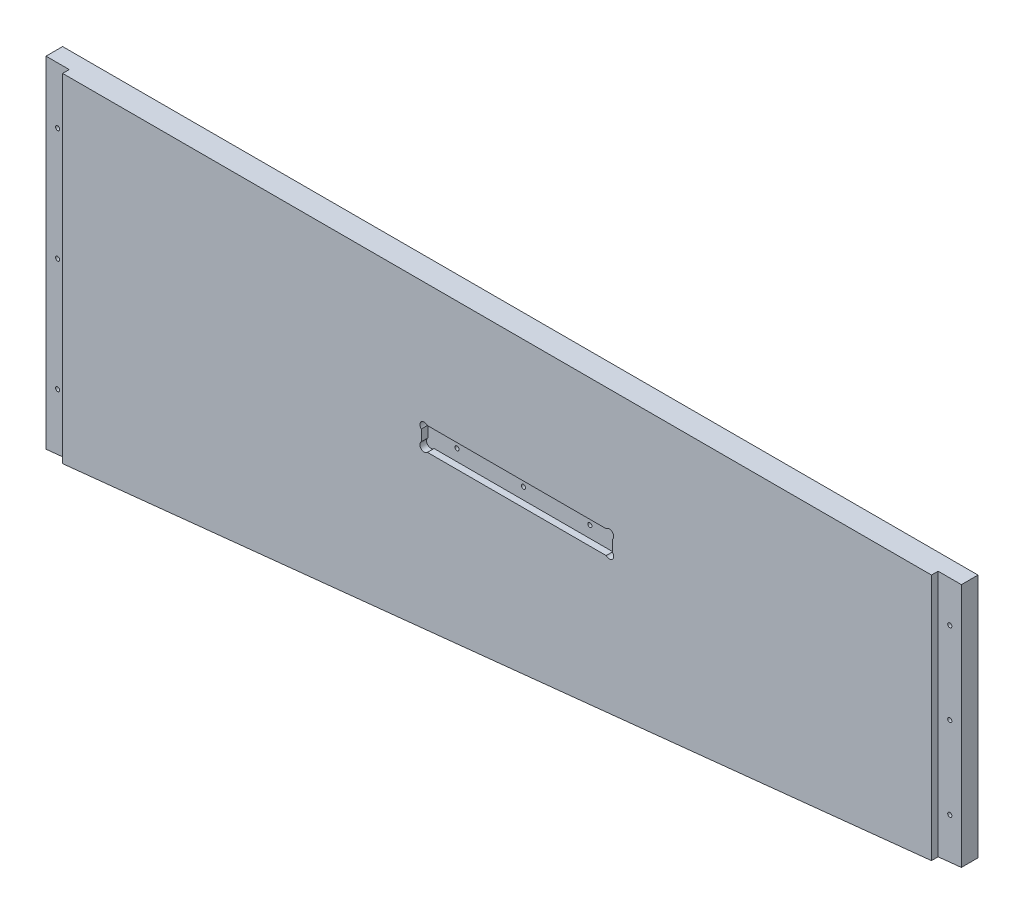
ISO-10303-21;
HEADER;
FILE_DESCRIPTION(('STEP AP214'),'2;1');
FILE_NAME('part.step','',(''),(''),'','','');
FILE_SCHEMA(('AUTOMOTIVE_DESIGN { 1 0 10303 214 1 1 1 1 }'));
ENDSEC;
DATA;
#1=APPLICATION_CONTEXT('core data for automotive mechanical design processes');
#2=APPLICATION_PROTOCOL_DEFINITION('international standard','automotive_design',2000,#1);
#3=PRODUCT_CONTEXT('',#1,'mechanical');
#4=PRODUCT('Part','Part','',(#3));
#5=PRODUCT_RELATED_PRODUCT_CATEGORY('part','',(#4));
#6=PRODUCT_DEFINITION_FORMATION('','',#4);
#7=PRODUCT_DEFINITION_CONTEXT('part definition',#1,'design');
#8=PRODUCT_DEFINITION('design','',#6,#7);
#9=PRODUCT_DEFINITION_SHAPE('','',#8);
#10=(LENGTH_UNIT() NAMED_UNIT(*) SI_UNIT(.MILLI.,.METRE.));
#11=(NAMED_UNIT(*) PLANE_ANGLE_UNIT() SI_UNIT($,.RADIAN.));
#12=(NAMED_UNIT(*) SI_UNIT($,.STERADIAN.) SOLID_ANGLE_UNIT());
#13=UNCERTAINTY_MEASURE_WITH_UNIT(LENGTH_MEASURE(1.E-05),#10,'distance_accuracy_value','');
#14=(GEOMETRIC_REPRESENTATION_CONTEXT(3) GLOBAL_UNCERTAINTY_ASSIGNED_CONTEXT((#13)) GLOBAL_UNIT_ASSIGNED_CONTEXT((#10,
#11,#12)) REPRESENTATION_CONTEXT('',''));
#15=CARTESIAN_POINT('',(0.,0.,0.));
#16=DIRECTION('',(0.,0.,1.));
#17=DIRECTION('',(1.,0.,0.));
#18=AXIS2_PLACEMENT_3D('',#15,#16,#17);
#19=CARTESIAN_POINT('',(573.0875,-5417.566,-22.2701280605353));
#20=DIRECTION('',(0.,0.,1.));
#21=DIRECTION('',(1.,0.,0.));
#22=AXIS2_PLACEMENT_3D('',#19,#20,#21);
#23=CYLINDRICAL_SURFACE('',#22,1.58749999999985);
#24=CARTESIAN_POINT('',(573.0875,-5417.566,-17.78));
#25=DIRECTION('',(0.,0.,1.));
#26=DIRECTION('',(1.,0.,0.));
#27=AXIS2_PLACEMENT_3D('',#24,#25,#26);
#28=CIRCLE('',#27,1.58749999999985);
#29=CARTESIAN_POINT('',(574.675,-5417.566,-17.78));
#30=VERTEX_POINT('',#29);
#31=EDGE_CURVE('E244',#30,#30,#28,.F.);
#32=ORIENTED_EDGE('',*,*,#31,.T.);
#33=EDGE_LOOP('',(#32));
#34=FACE_BOUND('',#33,.T.);
#35=CARTESIAN_POINT('',(573.0875,-5417.566,-5.08));
#36=DIRECTION('',(0.,0.,1.));
#37=DIRECTION('',(1.,0.,0.));
#38=AXIS2_PLACEMENT_3D('',#35,#36,#37);
#39=CIRCLE('',#38,1.58749999999985);
#40=CARTESIAN_POINT('',(574.675,-5417.566,-5.08));
#41=VERTEX_POINT('',#40);
#42=EDGE_CURVE('E187',#41,#41,#39,.F.);
#43=ORIENTED_EDGE('',*,*,#42,.F.);
#44=EDGE_LOOP('',(#43));
#45=FACE_BOUND('',#44,.T.);
#46=ADVANCED_FACE('F31',(#34,#45),#23,.F.);
#47=CARTESIAN_POINT('',(522.2875,-5417.566,-22.2701280605353));
#48=DIRECTION('',(0.,0.,1.));
#49=DIRECTION('',(1.,0.,0.));
#50=AXIS2_PLACEMENT_3D('',#47,#48,#49);
#51=CYLINDRICAL_SURFACE('',#50,1.58749999999964);
#52=CARTESIAN_POINT('',(522.2875,-5417.566,-17.78));
#53=DIRECTION('',(0.,0.,1.));
#54=DIRECTION('',(1.,0.,0.));
#55=AXIS2_PLACEMENT_3D('',#52,#53,#54);
#56=CIRCLE('',#55,1.58749999999964);
#57=CARTESIAN_POINT('',(523.875,-5417.566,-17.78));
#58=VERTEX_POINT('',#57);
#59=EDGE_CURVE('E241',#58,#58,#56,.F.);
#60=ORIENTED_EDGE('',*,*,#59,.T.);
#61=EDGE_LOOP('',(#60));
#62=FACE_BOUND('',#61,.T.);
#63=CARTESIAN_POINT('',(522.2875,-5417.566,-5.08));
#64=DIRECTION('',(0.,0.,1.));
#65=DIRECTION('',(1.,0.,0.));
#66=AXIS2_PLACEMENT_3D('',#63,#64,#65);
#67=CIRCLE('',#66,1.58749999999964);
#68=CARTESIAN_POINT('',(523.875,-5417.566,-5.08));
#69=VERTEX_POINT('',#68);
#70=EDGE_CURVE('E184',#69,#69,#67,.F.);
#71=ORIENTED_EDGE('',*,*,#70,.F.);
#72=EDGE_LOOP('',(#71));
#73=FACE_BOUND('',#72,.T.);
#74=ADVANCED_FACE('F360',(#62,#73),#51,.F.);
#75=CARTESIAN_POINT('',(471.4875,-5417.566,-22.2701280605353));
#76=DIRECTION('',(0.,0.,1.));
#77=DIRECTION('',(1.,0.,0.));
#78=AXIS2_PLACEMENT_3D('',#75,#76,#77);
#79=CYLINDRICAL_SURFACE('',#78,1.58749999999969);
#80=CARTESIAN_POINT('',(471.4875,-5417.566,-17.78));
#81=DIRECTION('',(0.,0.,1.));
#82=DIRECTION('',(1.,0.,0.));
#83=AXIS2_PLACEMENT_3D('',#80,#81,#82);
#84=CIRCLE('',#83,1.58749999999969);
#85=CARTESIAN_POINT('',(473.075,-5417.566,-17.78));
#86=VERTEX_POINT('',#85);
#87=EDGE_CURVE('E238',#86,#86,#84,.F.);
#88=ORIENTED_EDGE('',*,*,#87,.T.);
#89=EDGE_LOOP('',(#88));
#90=FACE_BOUND('',#89,.T.);
#91=CARTESIAN_POINT('',(471.4875,-5417.566,-5.08));
#92=DIRECTION('',(0.,0.,1.));
#93=DIRECTION('',(1.,0.,0.));
#94=AXIS2_PLACEMENT_3D('',#91,#92,#93);
#95=CIRCLE('',#94,1.58749999999969);
#96=CARTESIAN_POINT('',(473.075,-5417.566,-5.08));
#97=VERTEX_POINT('',#96);
#98=EDGE_CURVE('E168',#97,#97,#95,.F.);
#99=ORIENTED_EDGE('',*,*,#98,.F.);
#100=EDGE_LOOP('',(#99));
#101=FACE_BOUND('',#100,.T.);
#102=ADVANCED_FACE('F366',(#90,#101),#79,.F.);
#103=CARTESIAN_POINT('',(857.25,-5502.275,-17.78));
#104=DIRECTION('',(1.,0.,0.));
#105=DIRECTION('',(0.,0.,-1.));
#106=AXIS2_PLACEMENT_3D('',#103,#104,#105);
#107=PLANE('',#106);
#108=DIRECTION('',(0.,0.,1.));
#109=VECTOR('',#108,1.);
#110=CARTESIAN_POINT('',(857.25,-5314.95,-17.78));
#111=LINE('',#110,#109);
#112=CARTESIAN_POINT('',(857.25,-5314.95,-17.78));
#113=VERTEX_POINT('',#112);
#114=CARTESIAN_POINT('',(857.25,-5314.95,-5.08));
#115=VERTEX_POINT('',#114);
#116=EDGE_CURVE('E290',#113,#115,#111,.T.);
#117=ORIENTED_EDGE('',*,*,#116,.T.);
#118=DIRECTION('',(0.,1.,0.));
#119=VECTOR('',#118,1.);
#120=CARTESIAN_POINT('',(857.25,-5504.1296031746,-5.08));
#121=LINE('',#120,#119);
#122=CARTESIAN_POINT('',(857.25,-5502.275,-5.08));
#123=VERTEX_POINT('',#122);
#124=EDGE_CURVE('E191',#123,#115,#121,.T.);
#125=ORIENTED_EDGE('',*,*,#124,.F.);
#126=DIRECTION('',(0.,0.,1.));
#127=VECTOR('',#126,1.);
#128=CARTESIAN_POINT('',(857.25,-5502.275,-17.78));
#129=LINE('',#128,#127);
#130=CARTESIAN_POINT('',(857.25,-5502.275,-17.78));
#131=VERTEX_POINT('',#130);
#132=EDGE_CURVE('E279',#131,#123,#129,.T.);
#133=ORIENTED_EDGE('',*,*,#132,.F.);
#134=DIRECTION('',(0.,1.,0.));
#135=VECTOR('',#134,1.);
#136=CARTESIAN_POINT('',(857.25,-5502.275,-17.78));
#137=LINE('',#136,#135);
#138=EDGE_CURVE('E269',#131,#113,#137,.T.);
#139=ORIENTED_EDGE('',*,*,#138,.T.);
#140=EDGE_LOOP('',(#117,#125,#133,#139));
#141=FACE_BOUND('',#140,.T.);
#142=ADVANCED_FACE('F384',(#141),#107,.T.);
#143=CARTESIAN_POINT('',(848.36,-5471.82691799052,-22.2701280605353));
#144=DIRECTION('',(0.,0.,1.));
#145=DIRECTION('',(1.,0.,0.));
#146=AXIS2_PLACEMENT_3D('',#143,#144,#145);
#147=CYLINDRICAL_SURFACE('',#146,1.58749999999964);
#148=CARTESIAN_POINT('',(848.36,-5471.82691799052,-17.78));
#149=DIRECTION('',(0.,0.,1.));
#150=DIRECTION('',(1.,0.,0.));
#151=AXIS2_PLACEMENT_3D('',#148,#149,#150);
#152=CIRCLE('',#151,1.58749999999964);
#153=CARTESIAN_POINT('',(849.9475,-5471.82691799052,-17.78));
#154=VERTEX_POINT('',#153);
#155=EDGE_CURVE('E253',#154,#154,#152,.F.);
#156=ORIENTED_EDGE('',*,*,#155,.T.);
#157=EDGE_LOOP('',(#156));
#158=FACE_BOUND('',#157,.T.);
#159=CARTESIAN_POINT('',(848.36,-5471.82691799052,-5.08));
#160=DIRECTION('',(0.,0.,1.));
#161=DIRECTION('',(1.,0.,0.));
#162=AXIS2_PLACEMENT_3D('',#159,#160,#161);
#163=CIRCLE('',#162,1.58749999999964);
#164=CARTESIAN_POINT('',(849.9475,-5471.82691799052,-5.08));
#165=VERTEX_POINT('',#164);
#166=EDGE_CURVE('E208',#165,#165,#163,.F.);
#167=ORIENTED_EDGE('',*,*,#166,.F.);
#168=EDGE_LOOP('',(#167));
#169=FACE_BOUND('',#168,.T.);
#170=ADVANCED_FACE('F380',(#158,#169),#147,.F.);
#171=CARTESIAN_POINT('',(848.36,-5409.07615079482,-22.2701280605353));
#172=DIRECTION('',(0.,0.,1.));
#173=DIRECTION('',(1.,0.,0.));
#174=AXIS2_PLACEMENT_3D('',#171,#172,#173);
#175=CYLINDRICAL_SURFACE('',#174,1.58749999999996);
#176=CARTESIAN_POINT('',(848.36,-5409.07615079482,-17.78));
#177=DIRECTION('',(0.,0.,1.));
#178=DIRECTION('',(1.,0.,0.));
#179=AXIS2_PLACEMENT_3D('',#176,#177,#178);
#180=CIRCLE('',#179,1.58749999999996);
#181=CARTESIAN_POINT('',(849.9475,-5409.07615079482,-17.78));
#182=VERTEX_POINT('',#181);
#183=EDGE_CURVE('E250',#182,#182,#180,.F.);
#184=ORIENTED_EDGE('',*,*,#183,.T.);
#185=EDGE_LOOP('',(#184));
#186=FACE_BOUND('',#185,.T.);
#187=CARTESIAN_POINT('',(848.36,-5409.07615079482,-5.08));
#188=DIRECTION('',(0.,0.,1.));
#189=DIRECTION('',(1.,0.,0.));
#190=AXIS2_PLACEMENT_3D('',#187,#188,#189);
#191=CIRCLE('',#190,1.58749999999996);
#192=CARTESIAN_POINT('',(849.9475,-5409.07615079482,-5.08));
#193=VERTEX_POINT('',#192);
#194=EDGE_CURVE('E205',#193,#193,#191,.F.);
#195=ORIENTED_EDGE('',*,*,#194,.F.);
#196=EDGE_LOOP('',(#195));
#197=FACE_BOUND('',#196,.T.);
#198=ADVANCED_FACE('F376',(#186,#197),#175,.F.);
#199=CARTESIAN_POINT('',(848.36,-5346.32538359912,-22.2701280605353));
#200=DIRECTION('',(0.,0.,1.));
#201=DIRECTION('',(1.,0.,0.));
#202=AXIS2_PLACEMENT_3D('',#199,#200,#201);
#203=CYLINDRICAL_SURFACE('',#202,1.58749999999985);
#204=CARTESIAN_POINT('',(848.36,-5346.32538359912,-17.78));
#205=DIRECTION('',(0.,0.,1.));
#206=DIRECTION('',(1.,0.,0.));
#207=AXIS2_PLACEMENT_3D('',#204,#205,#206);
#208=CIRCLE('',#207,1.58749999999985);
#209=CARTESIAN_POINT('',(849.9475,-5346.32538359912,-17.78));
#210=VERTEX_POINT('',#209);
#211=EDGE_CURVE('E247',#210,#210,#208,.F.);
#212=ORIENTED_EDGE('',*,*,#211,.T.);
#213=EDGE_LOOP('',(#212));
#214=FACE_BOUND('',#213,.T.);
#215=CARTESIAN_POINT('',(848.36,-5346.32538359912,-5.08));
#216=DIRECTION('',(0.,0.,1.));
#217=DIRECTION('',(1.,0.,0.));
#218=AXIS2_PLACEMENT_3D('',#215,#216,#217);
#219=CIRCLE('',#218,1.58749999999985);
#220=CARTESIAN_POINT('',(849.9475,-5346.32538359912,-5.08));
#221=VERTEX_POINT('',#220);
#222=EDGE_CURVE('E203',#221,#221,#219,.F.);
#223=ORIENTED_EDGE('',*,*,#222,.F.);
#224=EDGE_LOOP('',(#223));
#225=FACE_BOUND('',#224,.T.);
#226=ADVANCED_FACE('F372',(#214,#225),#203,.F.);
#227=CARTESIAN_POINT('',(157.1625,-5314.95,-17.78));
#228=DIRECTION('',(-1.,0.,0.));
#229=DIRECTION('',(0.,0.,1.));
#230=AXIS2_PLACEMENT_3D('',#227,#228,#229);
#231=PLANE('',#230);
#232=DIRECTION('',(0.,0.,1.));
#233=VECTOR('',#232,1.);
#234=CARTESIAN_POINT('',(157.1625,-5575.3,-17.78));
#235=LINE('',#234,#233);
#236=CARTESIAN_POINT('',(157.1625,-5575.3,-17.78));
#237=VERTEX_POINT('',#236);
#238=CARTESIAN_POINT('',(157.1625,-5575.3,-5.08));
#239=VERTEX_POINT('',#238);
#240=EDGE_CURVE('E283',#237,#239,#235,.T.);
#241=ORIENTED_EDGE('',*,*,#240,.T.);
#242=DIRECTION('',(0.,-1.,0.));
#243=VECTOR('',#242,1.);
#244=CARTESIAN_POINT('',(157.1625,-5314.95,-5.08));
#245=LINE('',#244,#243);
#246=CARTESIAN_POINT('',(157.1625,-5314.95,-5.08));
#247=VERTEX_POINT('',#246);
#248=EDGE_CURVE('E217',#247,#239,#245,.T.);
#249=ORIENTED_EDGE('',*,*,#248,.F.);
#250=DIRECTION('',(0.,0.,1.));
#251=VECTOR('',#250,1.);
#252=CARTESIAN_POINT('',(157.1625,-5314.95,-17.78));
#253=LINE('',#252,#251);
#254=CARTESIAN_POINT('',(157.1625,-5314.95,-17.78));
#255=VERTEX_POINT('',#254);
#256=EDGE_CURVE('E287',#255,#247,#253,.T.);
#257=ORIENTED_EDGE('',*,*,#256,.F.);
#258=DIRECTION('',(0.,-1.,0.));
#259=VECTOR('',#258,1.);
#260=CARTESIAN_POINT('',(157.1625,-5314.95,-17.78));
#261=LINE('',#260,#259);
#262=EDGE_CURVE('E276',#255,#237,#261,.T.);
#263=ORIENTED_EDGE('',*,*,#262,.T.);
#264=EDGE_LOOP('',(#241,#249,#257,#263));
#265=FACE_BOUND('',#264,.T.);
#266=ADVANCED_FACE('F375',(#265),#231,.T.);
#267=CARTESIAN_POINT('',(166.0525,-5531.13558200948,-22.2701280605353));
#268=DIRECTION('',(0.,0.,1.));
#269=DIRECTION('',(1.,0.,0.));
#270=AXIS2_PLACEMENT_3D('',#267,#268,#269);
#271=CYLINDRICAL_SURFACE('',#270,1.58750000000025);
#272=CARTESIAN_POINT('',(166.0525,-5531.13558200948,-17.78));
#273=DIRECTION('',(0.,0.,1.));
#274=DIRECTION('',(1.,0.,0.));
#275=AXIS2_PLACEMENT_3D('',#272,#273,#274);
#276=CIRCLE('',#275,1.58750000000025);
#277=CARTESIAN_POINT('',(167.64,-5531.13558200948,-17.78));
#278=VERTEX_POINT('',#277);
#279=EDGE_CURVE('E262',#278,#278,#276,.F.);
#280=ORIENTED_EDGE('',*,*,#279,.T.);
#281=EDGE_LOOP('',(#280));
#282=FACE_BOUND('',#281,.T.);
#283=CARTESIAN_POINT('',(166.0525,-5531.13558200948,-5.08));
#284=DIRECTION('',(0.,0.,1.));
#285=DIRECTION('',(1.,0.,0.));
#286=AXIS2_PLACEMENT_3D('',#283,#284,#285);
#287=CIRCLE('',#286,1.58750000000025);
#288=CARTESIAN_POINT('',(167.64,-5531.13558200948,-5.08));
#289=VERTEX_POINT('',#288);
#290=EDGE_CURVE('E230',#289,#289,#287,.F.);
#291=ORIENTED_EDGE('',*,*,#290,.F.);
#292=EDGE_LOOP('',(#291));
#293=FACE_BOUND('',#292,.T.);
#294=ADVANCED_FACE('F393',(#282,#293),#271,.F.);
#295=CARTESIAN_POINT('',(166.0525,-5444.66134920518,-22.2701280605353));
#296=DIRECTION('',(0.,0.,1.));
#297=DIRECTION('',(1.,0.,0.));
#298=AXIS2_PLACEMENT_3D('',#295,#296,#297);
#299=CYLINDRICAL_SURFACE('',#298,1.58749999999974);
#300=CARTESIAN_POINT('',(166.0525,-5444.66134920518,-17.78));
#301=DIRECTION('',(0.,0.,1.));
#302=DIRECTION('',(1.,0.,0.));
#303=AXIS2_PLACEMENT_3D('',#300,#301,#302);
#304=CIRCLE('',#303,1.58749999999974);
#305=CARTESIAN_POINT('',(167.64,-5444.66134920518,-17.78));
#306=VERTEX_POINT('',#305);
#307=EDGE_CURVE('E259',#306,#306,#304,.F.);
#308=ORIENTED_EDGE('',*,*,#307,.T.);
#309=EDGE_LOOP('',(#308));
#310=FACE_BOUND('',#309,.T.);
#311=CARTESIAN_POINT('',(166.0525,-5444.66134920518,-5.08));
#312=DIRECTION('',(0.,0.,1.));
#313=DIRECTION('',(1.,0.,0.));
#314=AXIS2_PLACEMENT_3D('',#311,#312,#313);
#315=CIRCLE('',#314,1.58749999999974);
#316=CARTESIAN_POINT('',(167.64,-5444.66134920518,-5.08));
#317=VERTEX_POINT('',#316);
#318=EDGE_CURVE('E227',#317,#317,#315,.F.);
#319=ORIENTED_EDGE('',*,*,#318,.F.);
#320=EDGE_LOOP('',(#319));
#321=FACE_BOUND('',#320,.T.);
#322=ADVANCED_FACE('F389',(#310,#321),#299,.F.);
#323=CARTESIAN_POINT('',(166.0525,-5358.18711640088,-22.2701280605353));
#324=DIRECTION('',(0.,0.,1.));
#325=DIRECTION('',(1.,0.,0.));
#326=AXIS2_PLACEMENT_3D('',#323,#324,#325);
#327=CYLINDRICAL_SURFACE('',#326,1.58750000000006);
#328=CARTESIAN_POINT('',(166.0525,-5358.18711640088,-17.78));
#329=DIRECTION('',(0.,0.,1.));
#330=DIRECTION('',(1.,0.,0.));
#331=AXIS2_PLACEMENT_3D('',#328,#329,#330);
#332=CIRCLE('',#331,1.58750000000006);
#333=CARTESIAN_POINT('',(167.64,-5358.18711640088,-17.78));
#334=VERTEX_POINT('',#333);
#335=EDGE_CURVE('E256',#334,#334,#332,.F.);
#336=ORIENTED_EDGE('',*,*,#335,.T.);
#337=EDGE_LOOP('',(#336));
#338=FACE_BOUND('',#337,.T.);
#339=CARTESIAN_POINT('',(166.0525,-5358.18711640088,-5.08));
#340=DIRECTION('',(0.,0.,1.));
#341=DIRECTION('',(1.,0.,0.));
#342=AXIS2_PLACEMENT_3D('',#339,#340,#341);
#343=CIRCLE('',#342,1.58750000000006);
#344=CARTESIAN_POINT('',(167.64,-5358.18711640088,-5.08));
#345=VERTEX_POINT('',#344);
#346=EDGE_CURVE('E226',#345,#345,#343,.F.);
#347=ORIENTED_EDGE('',*,*,#346,.F.);
#348=EDGE_LOOP('',(#347));
#349=FACE_BOUND('',#348,.T.);
#350=ADVANCED_FACE('F386',(#338,#349),#327,.F.);
#351=CARTESIAN_POINT('',(157.1625,-5575.3,-17.78));
#352=DIRECTION('',(0.103745528759361,-0.994603873540839,0.));
#353=DIRECTION('',(0.994603873540839,0.103745528759361,0.));
#354=AXIS2_PLACEMENT_3D('',#351,#352,#353);
#355=PLANE('',#354);
#356=DIRECTION('',(0.,0.,1.));
#357=VECTOR('',#356,1.);
#358=CARTESIAN_POINT('',(839.47,-5504.1296031746,-5.08));
#359=LINE('',#358,#357);
#360=CARTESIAN_POINT('',(839.47,-5504.1296031746,-5.08));
#361=VERTEX_POINT('',#360);
#362=CARTESIAN_POINT('',(839.47,-5504.1296031746,0.));
#363=VERTEX_POINT('',#362);
#364=EDGE_CURVE('E200',#361,#363,#359,.T.);
#365=ORIENTED_EDGE('',*,*,#364,.T.);
#366=DIRECTION('',(0.994603873540839,0.103745528759361,0.));
#367=VECTOR('',#366,1.);
#368=CARTESIAN_POINT('',(157.1625,-5575.3,0.));
#369=LINE('',#368,#367);
#370=CARTESIAN_POINT('',(174.9425,-5573.4453968254,0.));
#371=VERTEX_POINT('',#370);
#372=EDGE_CURVE('E265',#371,#363,#369,.T.);
#373=ORIENTED_EDGE('',*,*,#372,.F.);
#374=DIRECTION('',(0.,0.,1.));
#375=VECTOR('',#374,1.);
#376=CARTESIAN_POINT('',(174.9425,-5573.4453968254,-17.78));
#377=LINE('',#376,#375);
#378=CARTESIAN_POINT('',(174.9425,-5573.4453968254,-5.08));
#379=VERTEX_POINT('',#378);
#380=EDGE_CURVE('E236',#379,#371,#377,.T.);
#381=ORIENTED_EDGE('',*,*,#380,.F.);
#382=DIRECTION('',(-0.994603873540839,-0.103745528759361,0.));
#383=VECTOR('',#382,1.);
#384=CARTESIAN_POINT('',(157.1625,-5575.3,-5.08));
#385=LINE('',#384,#383);
#386=EDGE_CURVE('E233',#379,#239,#385,.T.);
#387=ORIENTED_EDGE('',*,*,#386,.T.);
#388=ORIENTED_EDGE('',*,*,#240,.F.);
#389=DIRECTION('',(0.994603873540839,0.103745528759361,0.));
#390=VECTOR('',#389,1.);
#391=CARTESIAN_POINT('',(157.1625,-5575.3,-17.78));
#392=LINE('',#391,#390);
#393=EDGE_CURVE('E266',#237,#131,#392,.T.);
#394=ORIENTED_EDGE('',*,*,#393,.T.);
#395=ORIENTED_EDGE('',*,*,#132,.T.);
#396=DIRECTION('',(-0.994603873540839,-0.103745528759361,0.));
#397=VECTOR('',#396,1.);
#398=CARTESIAN_POINT('',(157.1625,-5575.3,-5.08));
#399=LINE('',#398,#397);
#400=EDGE_CURVE('E211',#123,#361,#399,.T.);
#401=ORIENTED_EDGE('',*,*,#400,.T.);
#402=EDGE_LOOP('',(#365,#373,#381,#387,#388,#394,#395,#401));
#403=FACE_BOUND('',#402,.T.);
#404=ADVANCED_FACE('F33',(#403),#355,.T.);
#405=CARTESIAN_POINT('',(857.25,-5314.95,-17.78));
#406=DIRECTION('',(0.,1.,0.));
#407=DIRECTION('',(0.,0.,1.));
#408=AXIS2_PLACEMENT_3D('',#405,#406,#407);
#409=PLANE('',#408);
#410=DIRECTION('',(0.,0.,1.));
#411=VECTOR('',#410,1.);
#412=CARTESIAN_POINT('',(839.47,-5314.95,-5.08));
#413=LINE('',#412,#411);
#414=CARTESIAN_POINT('',(839.47,-5314.95,-5.08));
#415=VERTEX_POINT('',#414);
#416=CARTESIAN_POINT('',(839.47,-5314.95,0.));
#417=VERTEX_POINT('',#416);
#418=EDGE_CURVE('E54',#415,#417,#413,.T.);
#419=ORIENTED_EDGE('',*,*,#418,.F.);
#420=DIRECTION('',(-1.,0.,0.));
#421=VECTOR('',#420,1.);
#422=CARTESIAN_POINT('',(857.25,-5314.95,-5.08));
#423=LINE('',#422,#421);
#424=EDGE_CURVE('E193',#115,#415,#423,.T.);
#425=ORIENTED_EDGE('',*,*,#424,.F.);
#426=ORIENTED_EDGE('',*,*,#116,.F.);
#427=DIRECTION('',(-1.,0.,0.));
#428=VECTOR('',#427,1.);
#429=CARTESIAN_POINT('',(857.25,-5314.95,-17.78));
#430=LINE('',#429,#428);
#431=EDGE_CURVE('E273',#113,#255,#430,.T.);
#432=ORIENTED_EDGE('',*,*,#431,.T.);
#433=ORIENTED_EDGE('',*,*,#256,.T.);
#434=DIRECTION('',(-1.,0.,0.));
#435=VECTOR('',#434,1.);
#436=CARTESIAN_POINT('',(174.9425,-5314.95,-5.08));
#437=LINE('',#436,#435);
#438=CARTESIAN_POINT('',(174.9425,-5314.95,-5.08));
#439=VERTEX_POINT('',#438);
#440=EDGE_CURVE('E215',#439,#247,#437,.T.);
#441=ORIENTED_EDGE('',*,*,#440,.F.);
#442=DIRECTION('',(0.,0.,1.));
#443=VECTOR('',#442,1.);
#444=CARTESIAN_POINT('',(174.9425,-5314.95,-5.08));
#445=LINE('',#444,#443);
#446=CARTESIAN_POINT('',(174.9425,-5314.95,0.));
#447=VERTEX_POINT('',#446);
#448=EDGE_CURVE('E221',#439,#447,#445,.T.);
#449=ORIENTED_EDGE('',*,*,#448,.T.);
#450=DIRECTION('',(-1.,0.,0.));
#451=VECTOR('',#450,1.);
#452=CARTESIAN_POINT('',(857.25,-5314.95,0.));
#453=LINE('',#452,#451);
#454=EDGE_CURVE('E270',#417,#447,#453,.T.);
#455=ORIENTED_EDGE('',*,*,#454,.F.);
#456=EDGE_LOOP('',(#419,#425,#426,#432,#433,#441,#449,#455));
#457=FACE_BOUND('',#456,.T.);
#458=ADVANCED_FACE('F401',(#457),#409,.T.);
#459=CARTESIAN_POINT('',(857.25,-5502.275,-17.78));
#460=DIRECTION('',(0.,0.,1.));
#461=DIRECTION('',(1.,0.,0.));
#462=AXIS2_PLACEMENT_3D('',#459,#460,#461);
#463=PLANE('',#462);
#464=ORIENTED_EDGE('',*,*,#87,.F.);
#465=EDGE_LOOP('',(#464));
#466=FACE_BOUND('',#465,.T.);
#467=ORIENTED_EDGE('',*,*,#59,.F.);
#468=EDGE_LOOP('',(#467));
#469=FACE_BOUND('',#468,.T.);
#470=ORIENTED_EDGE('',*,*,#31,.F.);
#471=EDGE_LOOP('',(#470));
#472=FACE_BOUND('',#471,.T.);
#473=ORIENTED_EDGE('',*,*,#211,.F.);
#474=EDGE_LOOP('',(#473));
#475=FACE_BOUND('',#474,.T.);
#476=ORIENTED_EDGE('',*,*,#183,.F.);
#477=EDGE_LOOP('',(#476));
#478=FACE_BOUND('',#477,.T.);
#479=ORIENTED_EDGE('',*,*,#155,.F.);
#480=EDGE_LOOP('',(#479));
#481=FACE_BOUND('',#480,.T.);
#482=ORIENTED_EDGE('',*,*,#335,.F.);
#483=EDGE_LOOP('',(#482));
#484=FACE_BOUND('',#483,.T.);
#485=ORIENTED_EDGE('',*,*,#307,.F.);
#486=EDGE_LOOP('',(#485));
#487=FACE_BOUND('',#486,.T.);
#488=ORIENTED_EDGE('',*,*,#279,.F.);
#489=EDGE_LOOP('',(#488));
#490=FACE_BOUND('',#489,.T.);
#491=ORIENTED_EDGE('',*,*,#393,.F.);
#492=ORIENTED_EDGE('',*,*,#262,.F.);
#493=ORIENTED_EDGE('',*,*,#431,.F.);
#494=ORIENTED_EDGE('',*,*,#138,.F.);
#495=EDGE_LOOP('',(#491,#492,#493,#494));
#496=FACE_BOUND('',#495,.T.);
#497=ADVANCED_FACE('F398',(#466,#469,#472,#475,#478,#481,#484,#487,#490,#496),#463,.F.);
#498=CARTESIAN_POINT('',(857.25,-5502.275,0.));
#499=DIRECTION('',(0.,0.,1.));
#500=DIRECTION('',(1.,0.,0.));
#501=AXIS2_PLACEMENT_3D('',#498,#499,#500);
#502=PLANE('',#501);
#503=CARTESIAN_POINT('',(593.06743597096,-5410.92106402904,0.));
#504=DIRECTION('',(0.,0.,1.));
#505=DIRECTION('',(1.,0.,0.));
#506=AXIS2_PLACEMENT_3D('',#503,#504,#505);
#507=CIRCLE('',#506,3.30200000000012);
#508=CARTESIAN_POINT('',(595.312500001227,-5413.34240487659,0.));
#509=VERTEX_POINT('',#508);
#510=CARTESIAN_POINT('',(590.646095123413,-5408.67599999877,0.));
#511=VERTEX_POINT('',#510);
#512=EDGE_CURVE('E151',#509,#511,#507,.T.);
#513=ORIENTED_EDGE('',*,*,#512,.F.);
#514=DIRECTION('',(0.,1.,0.));
#515=VECTOR('',#514,1.);
#516=CARTESIAN_POINT('',(595.312500001227,-5408.67599999877,0.));
#517=LINE('',#516,#515);
#518=CARTESIAN_POINT('',(595.312500001227,-5421.78959512341,0.));
#519=VERTEX_POINT('',#518);
#520=EDGE_CURVE('E160',#519,#509,#517,.T.);
#521=ORIENTED_EDGE('',*,*,#520,.F.);
#522=CARTESIAN_POINT('',(593.06743597096,-5424.21093597096,0.));
#523=DIRECTION('',(0.,0.,1.));
#524=DIRECTION('',(1.,0.,0.));
#525=AXIS2_PLACEMENT_3D('',#522,#523,#524);
#526=CIRCLE('',#525,3.30200000000012);
#527=CARTESIAN_POINT('',(590.646095123413,-5426.45600000123,0.));
#528=VERTEX_POINT('',#527);
#529=EDGE_CURVE('E313',#528,#519,#526,.T.);
#530=ORIENTED_EDGE('',*,*,#529,.F.);
#531=DIRECTION('',(1.,0.,0.));
#532=VECTOR('',#531,1.);
#533=CARTESIAN_POINT('',(449.262499998773,-5426.45600000123,0.));
#534=LINE('',#533,#532);
#535=CARTESIAN_POINT('',(453.928904876587,-5426.45600000123,0.));
#536=VERTEX_POINT('',#535);
#537=EDGE_CURVE('E177',#536,#528,#534,.T.);
#538=ORIENTED_EDGE('',*,*,#537,.F.);
#539=CARTESIAN_POINT('',(451.50756402904,-5424.21093597096,0.));
#540=DIRECTION('',(0.,0.,1.));
#541=DIRECTION('',(1.,0.,0.));
#542=AXIS2_PLACEMENT_3D('',#539,#540,#541);
#543=CIRCLE('',#542,3.30200000000012);
#544=CARTESIAN_POINT('',(449.262499998773,-5421.78959512341,0.));
#545=VERTEX_POINT('',#544);
#546=EDGE_CURVE('E324',#545,#536,#543,.T.);
#547=ORIENTED_EDGE('',*,*,#546,.F.);
#548=DIRECTION('',(0.,-1.,0.));
#549=VECTOR('',#548,1.);
#550=CARTESIAN_POINT('',(449.262499998773,-5408.67599999877,0.));
#551=LINE('',#550,#549);
#552=CARTESIAN_POINT('',(449.262499998773,-5413.34240487659,0.));
#553=VERTEX_POINT('',#552);
#554=EDGE_CURVE('E174',#553,#545,#551,.T.);
#555=ORIENTED_EDGE('',*,*,#554,.F.);
#556=CARTESIAN_POINT('',(451.50756402904,-5410.92106402904,0.));
#557=DIRECTION('',(0.,0.,1.));
#558=DIRECTION('',(1.,0.,0.));
#559=AXIS2_PLACEMENT_3D('',#556,#557,#558);
#560=CIRCLE('',#559,3.30200000000012);
#561=CARTESIAN_POINT('',(453.928904876587,-5408.67599999877,0.));
#562=VERTEX_POINT('',#561);
#563=EDGE_CURVE('E330',#562,#553,#560,.T.);
#564=ORIENTED_EDGE('',*,*,#563,.F.);
#565=DIRECTION('',(-1.,0.,0.));
#566=VECTOR('',#565,1.);
#567=CARTESIAN_POINT('',(595.312500001227,-5408.67599999877,0.));
#568=LINE('',#567,#566);
#569=EDGE_CURVE('E182',#511,#562,#568,.T.);
#570=ORIENTED_EDGE('',*,*,#569,.F.);
#571=EDGE_LOOP('',(#513,#521,#530,#538,#547,#555,#564,#570));
#572=FACE_BOUND('',#571,.T.);
#573=DIRECTION('',(0.,-1.,0.));
#574=VECTOR('',#573,1.);
#575=CARTESIAN_POINT('',(839.47,-5314.95,0.));
#576=LINE('',#575,#574);
#577=EDGE_CURVE('E190',#417,#363,#576,.T.);
#578=ORIENTED_EDGE('',*,*,#577,.F.);
#579=ORIENTED_EDGE('',*,*,#454,.T.);
#580=DIRECTION('',(0.,1.,0.));
#581=VECTOR('',#580,1.);
#582=CARTESIAN_POINT('',(174.9425,-5575.3,0.));
#583=LINE('',#582,#581);
#584=EDGE_CURVE('E214',#371,#447,#583,.T.);
#585=ORIENTED_EDGE('',*,*,#584,.F.);
#586=ORIENTED_EDGE('',*,*,#372,.T.);
#587=EDGE_LOOP('',(#578,#579,#585,#586));
#588=FACE_BOUND('',#587,.T.);
#589=ADVANCED_FACE('F315',(#572,#588),#502,.T.);
#590=CARTESIAN_POINT('',(157.1625,-5314.95,-5.08));
#591=DIRECTION('',(0.,0.,1.));
#592=DIRECTION('',(1.,0.,0.));
#593=AXIS2_PLACEMENT_3D('',#590,#591,#592);
#594=PLANE('',#593);
#595=ORIENTED_EDGE('',*,*,#318,.T.);
#596=EDGE_LOOP('',(#595));
#597=FACE_BOUND('',#596,.T.);
#598=DIRECTION('',(0.,1.,0.));
#599=VECTOR('',#598,1.);
#600=CARTESIAN_POINT('',(174.9425,-5575.3,-5.08));
#601=LINE('',#600,#599);
#602=EDGE_CURVE('E219',#379,#439,#601,.T.);
#603=ORIENTED_EDGE('',*,*,#602,.T.);
#604=ORIENTED_EDGE('',*,*,#440,.T.);
#605=ORIENTED_EDGE('',*,*,#248,.T.);
#606=ORIENTED_EDGE('',*,*,#386,.F.);
#607=EDGE_LOOP('',(#603,#604,#605,#606));
#608=FACE_BOUND('',#607,.T.);
#609=ORIENTED_EDGE('',*,*,#346,.T.);
#610=EDGE_LOOP('',(#609));
#611=FACE_BOUND('',#610,.T.);
#612=ORIENTED_EDGE('',*,*,#290,.T.);
#613=EDGE_LOOP('',(#612));
#614=FACE_BOUND('',#613,.T.);
#615=ADVANCED_FACE('F405',(#597,#608,#611,#614),#594,.T.);
#616=CARTESIAN_POINT('',(174.9425,-5575.3,-5.08));
#617=DIRECTION('',(1.,0.,0.));
#618=DIRECTION('',(0.,0.,-1.));
#619=AXIS2_PLACEMENT_3D('',#616,#617,#618);
#620=PLANE('',#619);
#621=ORIENTED_EDGE('',*,*,#380,.T.);
#622=ORIENTED_EDGE('',*,*,#584,.T.);
#623=ORIENTED_EDGE('',*,*,#448,.F.);
#624=ORIENTED_EDGE('',*,*,#602,.F.);
#625=EDGE_LOOP('',(#621,#622,#623,#624));
#626=FACE_BOUND('',#625,.T.);
#627=ADVANCED_FACE('F433',(#626),#620,.F.);
#628=CARTESIAN_POINT('',(857.25,-5314.95,-5.08));
#629=DIRECTION('',(0.,0.,1.));
#630=DIRECTION('',(1.,0.,0.));
#631=AXIS2_PLACEMENT_3D('',#628,#629,#630);
#632=PLANE('',#631);
#633=ORIENTED_EDGE('',*,*,#194,.T.);
#634=EDGE_LOOP('',(#633));
#635=FACE_BOUND('',#634,.T.);
#636=ORIENTED_EDGE('',*,*,#124,.T.);
#637=ORIENTED_EDGE('',*,*,#424,.T.);
#638=DIRECTION('',(0.,-1.,0.));
#639=VECTOR('',#638,1.);
#640=CARTESIAN_POINT('',(839.47,-5314.95,-5.08));
#641=LINE('',#640,#639);
#642=EDGE_CURVE('E196',#415,#361,#641,.T.);
#643=ORIENTED_EDGE('',*,*,#642,.T.);
#644=ORIENTED_EDGE('',*,*,#400,.F.);
#645=EDGE_LOOP('',(#636,#637,#643,#644));
#646=FACE_BOUND('',#645,.T.);
#647=ORIENTED_EDGE('',*,*,#222,.T.);
#648=EDGE_LOOP('',(#647));
#649=FACE_BOUND('',#648,.T.);
#650=ORIENTED_EDGE('',*,*,#166,.T.);
#651=EDGE_LOOP('',(#650));
#652=FACE_BOUND('',#651,.T.);
#653=ADVANCED_FACE('F439',(#635,#646,#649,#652),#632,.T.);
#654=CARTESIAN_POINT('',(839.47,-5314.95,-5.08));
#655=DIRECTION('',(-1.,0.,0.));
#656=DIRECTION('',(0.,0.,1.));
#657=AXIS2_PLACEMENT_3D('',#654,#655,#656);
#658=PLANE('',#657);
#659=ORIENTED_EDGE('',*,*,#577,.T.);
#660=ORIENTED_EDGE('',*,*,#364,.F.);
#661=ORIENTED_EDGE('',*,*,#642,.F.);
#662=ORIENTED_EDGE('',*,*,#418,.T.);
#663=EDGE_LOOP('',(#659,#660,#661,#662));
#664=FACE_BOUND('',#663,.T.);
#665=ADVANCED_FACE('F437',(#664),#658,.F.);
#666=CARTESIAN_POINT('',(449.262499998773,-5426.45600000123,-5.08));
#667=DIRECTION('',(0.,0.,1.));
#668=DIRECTION('',(1.,0.,0.));
#669=AXIS2_PLACEMENT_3D('',#666,#667,#668);
#670=PLANE('',#669);
#671=DIRECTION('',(0.,1.,0.));
#672=VECTOR('',#671,1.);
#673=CARTESIAN_POINT('',(595.312500001227,-5408.67599999877,-5.08));
#674=LINE('',#673,#672);
#675=CARTESIAN_POINT('',(595.312500001227,-5421.78959512341,-5.08));
#676=VERTEX_POINT('',#675);
#677=CARTESIAN_POINT('',(595.312500001227,-5413.34240487659,-5.08));
#678=VERTEX_POINT('',#677);
#679=EDGE_CURVE('E158',#676,#678,#674,.T.);
#680=ORIENTED_EDGE('',*,*,#679,.T.);
#681=CARTESIAN_POINT('',(593.06743597096,-5410.92106402904,-5.08));
#682=DIRECTION('',(0.,0.,1.));
#683=DIRECTION('',(1.,0.,0.));
#684=AXIS2_PLACEMENT_3D('',#681,#682,#683);
#685=CIRCLE('',#684,3.30200000000012);
#686=CARTESIAN_POINT('',(590.646095123413,-5408.67599999877,-5.08));
#687=VERTEX_POINT('',#686);
#688=EDGE_CURVE('E144',#687,#678,#685,.F.);
#689=ORIENTED_EDGE('',*,*,#688,.F.);
#690=DIRECTION('',(-1.,0.,0.));
#691=VECTOR('',#690,1.);
#692=CARTESIAN_POINT('',(595.312500001227,-5408.67599999877,-5.08));
#693=LINE('',#692,#691);
#694=CARTESIAN_POINT('',(453.928904876587,-5408.67599999877,-5.08));
#695=VERTEX_POINT('',#694);
#696=EDGE_CURVE('E165',#687,#695,#693,.T.);
#697=ORIENTED_EDGE('',*,*,#696,.T.);
#698=CARTESIAN_POINT('',(451.50756402904,-5410.92106402904,-5.08));
#699=DIRECTION('',(0.,0.,1.));
#700=DIRECTION('',(1.,0.,0.));
#701=AXIS2_PLACEMENT_3D('',#698,#699,#700);
#702=CIRCLE('',#701,3.30200000000012);
#703=CARTESIAN_POINT('',(449.262499998773,-5413.34240487659,-5.08));
#704=VERTEX_POINT('',#703);
#705=EDGE_CURVE('E332',#704,#695,#702,.F.);
#706=ORIENTED_EDGE('',*,*,#705,.F.);
#707=DIRECTION('',(0.,-1.,0.));
#708=VECTOR('',#707,1.);
#709=CARTESIAN_POINT('',(449.262499998773,-5408.67599999877,-5.08));
#710=LINE('',#709,#708);
#711=CARTESIAN_POINT('',(449.262499998773,-5421.78959512341,-5.08));
#712=VERTEX_POINT('',#711);
#713=EDGE_CURVE('E170',#704,#712,#710,.T.);
#714=ORIENTED_EDGE('',*,*,#713,.T.);
#715=CARTESIAN_POINT('',(451.50756402904,-5424.21093597096,-5.08));
#716=DIRECTION('',(0.,0.,1.));
#717=DIRECTION('',(1.,0.,0.));
#718=AXIS2_PLACEMENT_3D('',#715,#716,#717);
#719=CIRCLE('',#718,3.30200000000012);
#720=CARTESIAN_POINT('',(453.928904876587,-5426.45600000123,-5.08));
#721=VERTEX_POINT('',#720);
#722=EDGE_CURVE('E46',#721,#712,#719,.F.);
#723=ORIENTED_EDGE('',*,*,#722,.F.);
#724=DIRECTION('',(1.,0.,0.));
#725=VECTOR('',#724,1.);
#726=CARTESIAN_POINT('',(449.262499998773,-5426.45600000123,-5.08));
#727=LINE('',#726,#725);
#728=CARTESIAN_POINT('',(590.646095123413,-5426.45600000123,-5.08));
#729=VERTEX_POINT('',#728);
#730=EDGE_CURVE('E166',#721,#729,#727,.T.);
#731=ORIENTED_EDGE('',*,*,#730,.T.);
#732=CARTESIAN_POINT('',(593.06743597096,-5424.21093597096,-5.08));
#733=DIRECTION('',(0.,0.,1.));
#734=DIRECTION('',(1.,0.,0.));
#735=AXIS2_PLACEMENT_3D('',#732,#733,#734);
#736=CIRCLE('',#735,3.30200000000012);
#737=EDGE_CURVE('E164',#676,#729,#736,.F.);
#738=ORIENTED_EDGE('',*,*,#737,.F.);
#739=EDGE_LOOP('',(#680,#689,#697,#706,#714,#723,#731,#738));
#740=FACE_BOUND('',#739,.T.);
#741=ORIENTED_EDGE('',*,*,#70,.T.);
#742=EDGE_LOOP('',(#741));
#743=FACE_BOUND('',#742,.T.);
#744=ORIENTED_EDGE('',*,*,#98,.T.);
#745=EDGE_LOOP('',(#744));
#746=FACE_BOUND('',#745,.T.);
#747=ORIENTED_EDGE('',*,*,#42,.T.);
#748=EDGE_LOOP('',(#747));
#749=FACE_BOUND('',#748,.T.);
#750=ADVANCED_FACE('F162',(#740,#743,#746,#749),#670,.T.);
#751=CARTESIAN_POINT('',(449.262499998773,-5408.67599999877,-5.08));
#752=DIRECTION('',(-1.,0.,0.));
#753=DIRECTION('',(0.,0.,1.));
#754=AXIS2_PLACEMENT_3D('',#751,#752,#753);
#755=PLANE('',#754);
#756=ORIENTED_EDGE('',*,*,#554,.T.);
#757=DIRECTION('',(0.,0.,1.));
#758=VECTOR('',#757,1.);
#759=CARTESIAN_POINT('',(449.262499998773,-5421.78959512341,-14.4194663659117));
#760=LINE('',#759,#758);
#761=EDGE_CURVE('E327',#545,#712,#760,.F.);
#762=ORIENTED_EDGE('',*,*,#761,.T.);
#763=ORIENTED_EDGE('',*,*,#713,.F.);
#764=DIRECTION('',(0.,0.,1.));
#765=VECTOR('',#764,1.);
#766=CARTESIAN_POINT('',(449.262499998773,-5413.34240487659,-14.4194663659117));
#767=LINE('',#766,#765);
#768=EDGE_CURVE('E178',#704,#553,#767,.T.);
#769=ORIENTED_EDGE('',*,*,#768,.T.);
#770=EDGE_LOOP('',(#756,#762,#763,#769));
#771=FACE_BOUND('',#770,.T.);
#772=ADVANCED_FACE('F339',(#771),#755,.F.);
#773=CARTESIAN_POINT('',(595.312500001227,-5408.67599999877,-5.08));
#774=DIRECTION('',(0.,1.,0.));
#775=DIRECTION('',(0.,0.,1.));
#776=AXIS2_PLACEMENT_3D('',#773,#774,#775);
#777=PLANE('',#776);
#778=ORIENTED_EDGE('',*,*,#696,.F.);
#779=DIRECTION('',(0.,0.,1.));
#780=VECTOR('',#779,1.);
#781=CARTESIAN_POINT('',(590.646095123413,-5408.67599999877,-14.4194663659117));
#782=LINE('',#781,#780);
#783=EDGE_CURVE('E148',#687,#511,#782,.T.);
#784=ORIENTED_EDGE('',*,*,#783,.T.);
#785=ORIENTED_EDGE('',*,*,#569,.T.);
#786=DIRECTION('',(0.,0.,1.));
#787=VECTOR('',#786,1.);
#788=CARTESIAN_POINT('',(453.928904876587,-5408.67599999877,-14.4194663659117));
#789=LINE('',#788,#787);
#790=EDGE_CURVE('E286',#562,#695,#789,.F.);
#791=ORIENTED_EDGE('',*,*,#790,.T.);
#792=EDGE_LOOP('',(#778,#784,#785,#791));
#793=FACE_BOUND('',#792,.T.);
#794=ADVANCED_FACE('F349',(#793),#777,.F.);
#795=CARTESIAN_POINT('',(595.312500001227,-5408.67599999877,-5.08));
#796=DIRECTION('',(1.,0.,0.));
#797=DIRECTION('',(0.,0.,-1.));
#798=AXIS2_PLACEMENT_3D('',#795,#796,#797);
#799=PLANE('',#798);
#800=ORIENTED_EDGE('',*,*,#520,.T.);
#801=DIRECTION('',(0.,0.,1.));
#802=VECTOR('',#801,1.);
#803=CARTESIAN_POINT('',(595.312500001227,-5413.34240487659,-14.4194663659117));
#804=LINE('',#803,#802);
#805=EDGE_CURVE('E11',#509,#678,#804,.F.);
#806=ORIENTED_EDGE('',*,*,#805,.T.);
#807=ORIENTED_EDGE('',*,*,#679,.F.);
#808=DIRECTION('',(0.,0.,1.));
#809=VECTOR('',#808,1.);
#810=CARTESIAN_POINT('',(595.312500001227,-5421.78959512341,-14.4194663659117));
#811=LINE('',#810,#809);
#812=EDGE_CURVE('E319',#676,#519,#811,.T.);
#813=ORIENTED_EDGE('',*,*,#812,.T.);
#814=EDGE_LOOP('',(#800,#806,#807,#813));
#815=FACE_BOUND('',#814,.T.);
#816=ADVANCED_FACE('F156',(#815),#799,.F.);
#817=CARTESIAN_POINT('',(449.262499998773,-5426.45600000123,-5.08));
#818=DIRECTION('',(0.,-1.,0.));
#819=DIRECTION('',(0.,0.,-1.));
#820=AXIS2_PLACEMENT_3D('',#817,#818,#819);
#821=PLANE('',#820);
#822=ORIENTED_EDGE('',*,*,#537,.T.);
#823=DIRECTION('',(0.,0.,1.));
#824=VECTOR('',#823,1.);
#825=CARTESIAN_POINT('',(590.646095123413,-5426.45600000123,-14.4194663659117));
#826=LINE('',#825,#824);
#827=EDGE_CURVE('E39',#528,#729,#826,.F.);
#828=ORIENTED_EDGE('',*,*,#827,.T.);
#829=ORIENTED_EDGE('',*,*,#730,.F.);
#830=DIRECTION('',(0.,0.,1.));
#831=VECTOR('',#830,1.);
#832=CARTESIAN_POINT('',(453.928904876587,-5426.45600000123,-14.4194663659117));
#833=LINE('',#832,#831);
#834=EDGE_CURVE('E303',#721,#536,#833,.T.);
#835=ORIENTED_EDGE('',*,*,#834,.T.);
#836=EDGE_LOOP('',(#822,#828,#829,#835));
#837=FACE_BOUND('',#836,.T.);
#838=ADVANCED_FACE('F308',(#837),#821,.F.);
#839=CARTESIAN_POINT('',(451.50756402904,-5410.92106402904,-14.4194663659117));
#840=DIRECTION('',(0.,0.,1.));
#841=DIRECTION('',(1.,0.,0.));
#842=AXIS2_PLACEMENT_3D('',#839,#840,#841);
#843=CYLINDRICAL_SURFACE('',#842,3.30200000000012);
#844=ORIENTED_EDGE('',*,*,#705,.T.);
#845=ORIENTED_EDGE('',*,*,#790,.F.);
#846=ORIENTED_EDGE('',*,*,#563,.T.);
#847=ORIENTED_EDGE('',*,*,#768,.F.);
#848=EDGE_LOOP('',(#844,#845,#846,#847));
#849=FACE_BOUND('',#848,.T.);
#850=ADVANCED_FACE('F347',(#849),#843,.F.);
#851=CARTESIAN_POINT('',(451.50756402904,-5424.21093597096,-14.4194663659117));
#852=DIRECTION('',(0.,0.,1.));
#853=DIRECTION('',(1.,0.,0.));
#854=AXIS2_PLACEMENT_3D('',#851,#852,#853);
#855=CYLINDRICAL_SURFACE('',#854,3.30200000000012);
#856=ORIENTED_EDGE('',*,*,#546,.T.);
#857=ORIENTED_EDGE('',*,*,#834,.F.);
#858=ORIENTED_EDGE('',*,*,#722,.T.);
#859=ORIENTED_EDGE('',*,*,#761,.F.);
#860=EDGE_LOOP('',(#856,#857,#858,#859));
#861=FACE_BOUND('',#860,.T.);
#862=ADVANCED_FACE('F342',(#861),#855,.F.);
#863=CARTESIAN_POINT('',(593.06743597096,-5424.21093597096,-14.4194663659117));
#864=DIRECTION('',(0.,0.,1.));
#865=DIRECTION('',(1.,0.,0.));
#866=AXIS2_PLACEMENT_3D('',#863,#864,#865);
#867=CYLINDRICAL_SURFACE('',#866,3.30200000000012);
#868=ORIENTED_EDGE('',*,*,#737,.T.);
#869=ORIENTED_EDGE('',*,*,#827,.F.);
#870=ORIENTED_EDGE('',*,*,#529,.T.);
#871=ORIENTED_EDGE('',*,*,#812,.F.);
#872=EDGE_LOOP('',(#868,#869,#870,#871));
#873=FACE_BOUND('',#872,.T.);
#874=ADVANCED_FACE('F312',(#873),#867,.F.);
#875=CARTESIAN_POINT('',(593.06743597096,-5410.92106402904,-14.4194663659117));
#876=DIRECTION('',(0.,0.,1.));
#877=DIRECTION('',(1.,0.,0.));
#878=AXIS2_PLACEMENT_3D('',#875,#876,#877);
#879=CYLINDRICAL_SURFACE('',#878,3.30200000000012);
#880=ORIENTED_EDGE('',*,*,#688,.T.);
#881=ORIENTED_EDGE('',*,*,#805,.F.);
#882=ORIENTED_EDGE('',*,*,#512,.T.);
#883=ORIENTED_EDGE('',*,*,#783,.F.);
#884=EDGE_LOOP('',(#880,#881,#882,#883));
#885=FACE_BOUND('',#884,.T.);
#886=ADVANCED_FACE('F145',(#885),#879,.F.);
#887=CLOSED_SHELL('',(#46,#74,#102,#142,#170,#198,#226,#266,#294,#322,#350,#404,#458,#497,#589,
#615,#627,#653,#665,#750,#772,#794,#816,#838,#850,#862,#874,#886));
#888=MANIFOLD_SOLID_BREP('B2',#887);
#889=ADVANCED_BREP_SHAPE_REPRESENTATION('',(#18,#888),#14);
#890=SHAPE_DEFINITION_REPRESENTATION(#9,#889);
ENDSEC;
END-ISO-10303-21;
